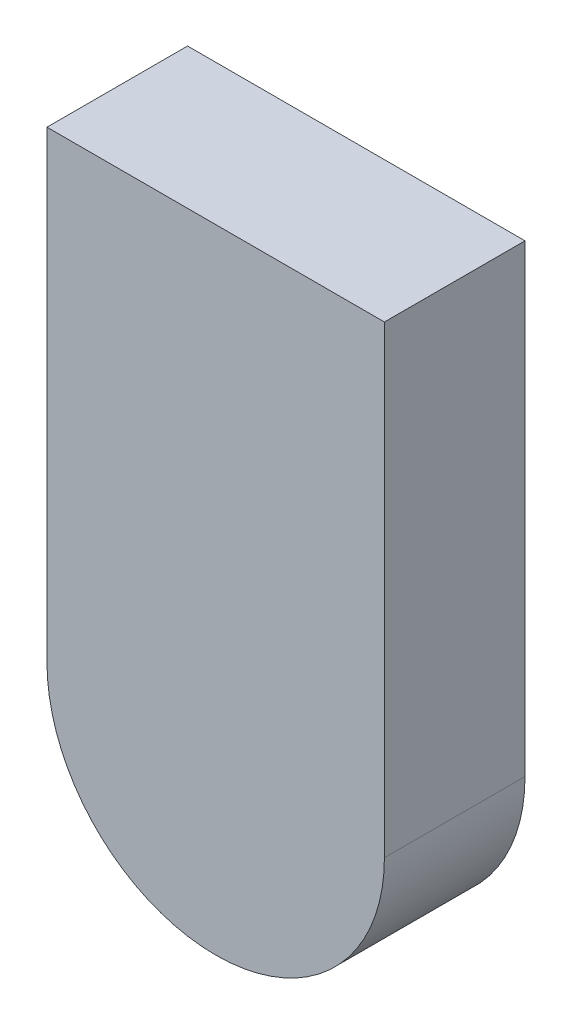
ISO-10303-21;
HEADER;
FILE_DESCRIPTION(('STEP AP214'),'2;1');
FILE_NAME('part.step','',(''),(''),'','','');
FILE_SCHEMA(('AUTOMOTIVE_DESIGN { 1 0 10303 214 1 1 1 1 }'));
ENDSEC;
DATA;
#1=APPLICATION_CONTEXT('core data for automotive mechanical design processes');
#2=APPLICATION_PROTOCOL_DEFINITION('international standard','automotive_design',2000,#1);
#3=PRODUCT_CONTEXT('',#1,'mechanical');
#4=PRODUCT('Part','Part','',(#3));
#5=PRODUCT_RELATED_PRODUCT_CATEGORY('part','',(#4));
#6=PRODUCT_DEFINITION_FORMATION('','',#4);
#7=PRODUCT_DEFINITION_CONTEXT('part definition',#1,'design');
#8=PRODUCT_DEFINITION('design','',#6,#7);
#9=PRODUCT_DEFINITION_SHAPE('','',#8);
#10=(LENGTH_UNIT() NAMED_UNIT(*) SI_UNIT(.MILLI.,.METRE.));
#11=(NAMED_UNIT(*) PLANE_ANGLE_UNIT() SI_UNIT($,.RADIAN.));
#12=(NAMED_UNIT(*) SI_UNIT($,.STERADIAN.) SOLID_ANGLE_UNIT());
#13=UNCERTAINTY_MEASURE_WITH_UNIT(LENGTH_MEASURE(1.E-05),#10,'distance_accuracy_value','');
#14=(GEOMETRIC_REPRESENTATION_CONTEXT(3) GLOBAL_UNCERTAINTY_ASSIGNED_CONTEXT((#13)) GLOBAL_UNIT_ASSIGNED_CONTEXT((#10,
#11,#12)) REPRESENTATION_CONTEXT('',''));
#15=CARTESIAN_POINT('',(0.,0.,0.));
#16=DIRECTION('',(0.,0.,1.));
#17=DIRECTION('',(1.,0.,0.));
#18=AXIS2_PLACEMENT_3D('',#15,#16,#17);
#19=CARTESIAN_POINT('',(-1.37,4.05,0.));
#20=DIRECTION('',(0.,1.,0.));
#21=DIRECTION('',(1.,0.,0.));
#22=AXIS2_PLACEMENT_3D('',#19,#20,#21);
#23=PLANE('',#22);
#24=DIRECTION('',(0.,0.,1.));
#25=VECTOR('',#24,1.);
#26=CARTESIAN_POINT('',(-1.37,4.05,0.));
#27=LINE('',#26,#25);
#28=CARTESIAN_POINT('',(-1.37,4.05,0.));
#29=VERTEX_POINT('',#28);
#30=CARTESIAN_POINT('',(-1.37,4.05,0.1));
#31=VERTEX_POINT('',#30);
#32=EDGE_CURVE('E11',#29,#31,#27,.T.);
#33=ORIENTED_EDGE('',*,*,#32,.T.);
#34=DIRECTION('',(1.,0.,0.));
#35=VECTOR('',#34,1.);
#36=CARTESIAN_POINT('',(-1.37,4.05,0.1));
#37=LINE('',#36,#35);
#38=CARTESIAN_POINT('',(-1.13,4.05,0.1));
#39=VERTEX_POINT('',#38);
#40=EDGE_CURVE('E24',#31,#39,#37,.T.);
#41=ORIENTED_EDGE('',*,*,#40,.T.);
#42=DIRECTION('',(0.,0.,1.));
#43=VECTOR('',#42,1.);
#44=CARTESIAN_POINT('',(-1.13,4.05,0.));
#45=LINE('',#44,#43);
#46=CARTESIAN_POINT('',(-1.13,4.05,0.));
#47=VERTEX_POINT('',#46);
#48=EDGE_CURVE('E85',#47,#39,#45,.T.);
#49=ORIENTED_EDGE('',*,*,#48,.F.);
#50=DIRECTION('',(1.,0.,0.));
#51=VECTOR('',#50,1.);
#52=CARTESIAN_POINT('',(-1.37,4.05,0.));
#53=LINE('',#52,#51);
#54=EDGE_CURVE('E82',#29,#47,#53,.T.);
#55=ORIENTED_EDGE('',*,*,#54,.F.);
#56=EDGE_LOOP('',(#33,#41,#49,#55));
#57=FACE_BOUND('',#56,.T.);
#58=ADVANCED_FACE('F17',(#57),#23,.T.);
#59=CARTESIAN_POINT('',(-1.13,4.05,0.));
#60=DIRECTION('',(1.,0.,0.));
#61=DIRECTION('',(0.,-1.,0.));
#62=AXIS2_PLACEMENT_3D('',#59,#60,#61);
#63=PLANE('',#62);
#64=ORIENTED_EDGE('',*,*,#48,.T.);
#65=DIRECTION('',(0.,-1.,0.));
#66=VECTOR('',#65,1.);
#67=CARTESIAN_POINT('',(-1.13,4.05,0.1));
#68=LINE('',#67,#66);
#69=CARTESIAN_POINT('',(-1.13,3.72,0.1));
#70=VERTEX_POINT('',#69);
#71=EDGE_CURVE('E80',#39,#70,#68,.T.);
#72=ORIENTED_EDGE('',*,*,#71,.T.);
#73=DIRECTION('',(0.,0.,1.));
#74=VECTOR('',#73,1.);
#75=CARTESIAN_POINT('',(-1.13,3.72,0.));
#76=LINE('',#75,#74);
#77=CARTESIAN_POINT('',(-1.13,3.72,0.));
#78=VERTEX_POINT('',#77);
#79=EDGE_CURVE('E60',#78,#70,#76,.T.);
#80=ORIENTED_EDGE('',*,*,#79,.F.);
#81=DIRECTION('',(0.,-1.,0.));
#82=VECTOR('',#81,1.);
#83=CARTESIAN_POINT('',(-1.13,4.05,0.));
#84=LINE('',#83,#82);
#85=EDGE_CURVE('E76',#47,#78,#84,.T.);
#86=ORIENTED_EDGE('',*,*,#85,.F.);
#87=EDGE_LOOP('',(#64,#72,#80,#86));
#88=FACE_BOUND('',#87,.T.);
#89=ADVANCED_FACE('F89',(#88),#63,.T.);
#90=CARTESIAN_POINT('',(-1.25,3.72,0.));
#91=DIRECTION('',(0.,0.,-1.));
#92=DIRECTION('',(1.,0.,0.));
#93=AXIS2_PLACEMENT_3D('',#90,#91,#92);
#94=CYLINDRICAL_SURFACE('',#93,0.12);
#95=CARTESIAN_POINT('',(-1.25,3.72,0.));
#96=DIRECTION('',(0.,0.,1.));
#97=DIRECTION('',(1.,0.,0.));
#98=AXIS2_PLACEMENT_3D('',#95,#96,#97);
#99=CIRCLE('',#98,0.12);
#100=CARTESIAN_POINT('',(-1.37,3.72,0.));
#101=VERTEX_POINT('',#100);
#102=EDGE_CURVE('E64',#101,#78,#99,.T.);
#103=ORIENTED_EDGE('',*,*,#102,.T.);
#104=ORIENTED_EDGE('',*,*,#79,.T.);
#105=CARTESIAN_POINT('',(-1.25,3.72,0.1));
#106=DIRECTION('',(0.,0.,1.));
#107=DIRECTION('',(1.,0.,0.));
#108=AXIS2_PLACEMENT_3D('',#105,#106,#107);
#109=CIRCLE('',#108,0.12);
#110=CARTESIAN_POINT('',(-1.37,3.72,0.1));
#111=VERTEX_POINT('',#110);
#112=EDGE_CURVE('E55',#111,#70,#109,.T.);
#113=ORIENTED_EDGE('',*,*,#112,.F.);
#114=DIRECTION('',(0.,0.,1.));
#115=VECTOR('',#114,1.);
#116=CARTESIAN_POINT('',(-1.37,3.72,0.));
#117=LINE('',#116,#115);
#118=EDGE_CURVE('E59',#101,#111,#117,.T.);
#119=ORIENTED_EDGE('',*,*,#118,.F.);
#120=EDGE_LOOP('',(#103,#104,#113,#119));
#121=FACE_BOUND('',#120,.T.);
#122=ADVANCED_FACE('F58',(#121),#94,.T.);
#123=CARTESIAN_POINT('',(-1.37,4.05,0.));
#124=DIRECTION('',(1.,0.,0.));
#125=DIRECTION('',(0.,-1.,0.));
#126=AXIS2_PLACEMENT_3D('',#123,#124,#125);
#127=PLANE('',#126);
#128=DIRECTION('',(0.,-1.,0.));
#129=VECTOR('',#128,1.);
#130=CARTESIAN_POINT('',(-1.37,4.05,0.));
#131=LINE('',#130,#129);
#132=EDGE_CURVE('E69',#29,#101,#131,.T.);
#133=ORIENTED_EDGE('',*,*,#132,.T.);
#134=ORIENTED_EDGE('',*,*,#118,.T.);
#135=DIRECTION('',(0.,-1.,0.));
#136=VECTOR('',#135,1.);
#137=CARTESIAN_POINT('',(-1.37,4.05,0.1));
#138=LINE('',#137,#136);
#139=EDGE_CURVE('E67',#31,#111,#138,.T.);
#140=ORIENTED_EDGE('',*,*,#139,.F.);
#141=ORIENTED_EDGE('',*,*,#32,.F.);
#142=EDGE_LOOP('',(#133,#134,#140,#141));
#143=FACE_BOUND('',#142,.T.);
#144=ADVANCED_FACE('F66',(#143),#127,.F.);
#145=CARTESIAN_POINT('',(-1.25,3.849490847913,0.));
#146=DIRECTION('',(0.,0.,-1.));
#147=DIRECTION('',(-1.,0.,0.));
#148=AXIS2_PLACEMENT_3D('',#145,#146,#147);
#149=PLANE('',#148);
#150=ORIENTED_EDGE('',*,*,#54,.T.);
#151=ORIENTED_EDGE('',*,*,#85,.T.);
#152=ORIENTED_EDGE('',*,*,#102,.F.);
#153=ORIENTED_EDGE('',*,*,#132,.F.);
#154=EDGE_LOOP('',(#150,#151,#152,#153));
#155=FACE_BOUND('',#154,.T.);
#156=ADVANCED_FACE('F91',(#155),#149,.T.);
#157=CARTESIAN_POINT('',(-1.25,3.849490847913,0.1));
#158=DIRECTION('',(0.,0.,-1.));
#159=DIRECTION('',(-1.,0.,0.));
#160=AXIS2_PLACEMENT_3D('',#157,#158,#159);
#161=PLANE('',#160);
#162=ORIENTED_EDGE('',*,*,#139,.T.);
#163=ORIENTED_EDGE('',*,*,#112,.T.);
#164=ORIENTED_EDGE('',*,*,#71,.F.);
#165=ORIENTED_EDGE('',*,*,#40,.F.);
#166=EDGE_LOOP('',(#162,#163,#164,#165));
#167=FACE_BOUND('',#166,.T.);
#168=ADVANCED_FACE('F71',(#167),#161,.F.);
#169=CLOSED_SHELL('',(#58,#89,#122,#144,#156,#168));
#170=MANIFOLD_SOLID_BREP('B1',#169);
#171=ADVANCED_BREP_SHAPE_REPRESENTATION('',(#18,#170),#14);
#172=SHAPE_DEFINITION_REPRESENTATION(#9,#171);
ENDSEC;
END-ISO-10303-21;
